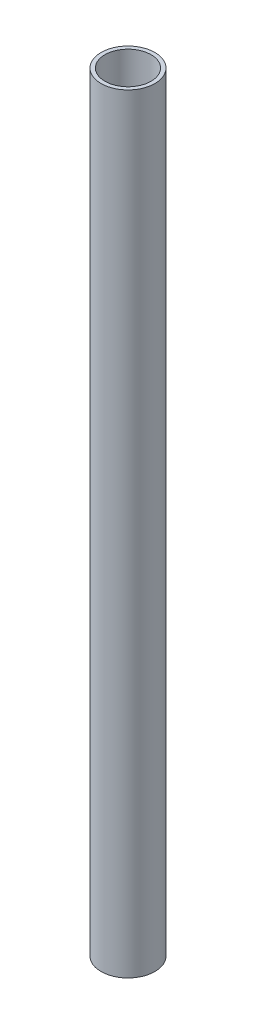
ISO-10303-21;
HEADER;
FILE_DESCRIPTION(('STEP AP214'),'2;1');
FILE_NAME('part.step','',(''),(''),'','','');
FILE_SCHEMA(('AUTOMOTIVE_DESIGN { 1 0 10303 214 1 1 1 1 }'));
ENDSEC;
DATA;
#1=APPLICATION_CONTEXT('core data for automotive mechanical design processes');
#2=APPLICATION_PROTOCOL_DEFINITION('international standard','automotive_design',2000,#1);
#3=PRODUCT_CONTEXT('',#1,'mechanical');
#4=PRODUCT('Part','Part','',(#3));
#5=PRODUCT_RELATED_PRODUCT_CATEGORY('part','',(#4));
#6=PRODUCT_DEFINITION_FORMATION('','',#4);
#7=PRODUCT_DEFINITION_CONTEXT('part definition',#1,'design');
#8=PRODUCT_DEFINITION('design','',#6,#7);
#9=PRODUCT_DEFINITION_SHAPE('','',#8);
#10=(LENGTH_UNIT() NAMED_UNIT(*) SI_UNIT(.MILLI.,.METRE.));
#11=(NAMED_UNIT(*) PLANE_ANGLE_UNIT() SI_UNIT($,.RADIAN.));
#12=(NAMED_UNIT(*) SI_UNIT($,.STERADIAN.) SOLID_ANGLE_UNIT());
#13=UNCERTAINTY_MEASURE_WITH_UNIT(LENGTH_MEASURE(1.E-05),#10,'distance_accuracy_value','');
#14=(GEOMETRIC_REPRESENTATION_CONTEXT(3) GLOBAL_UNCERTAINTY_ASSIGNED_CONTEXT((#13)) GLOBAL_UNIT_ASSIGNED_CONTEXT((#10,
#11,#12)) REPRESENTATION_CONTEXT('',''));
#15=CARTESIAN_POINT('',(0.,0.,0.));
#16=DIRECTION('',(0.,0.,1.));
#17=DIRECTION('',(1.,0.,0.));
#18=AXIS2_PLACEMENT_3D('',#15,#16,#17);
#19=CARTESIAN_POINT('',(0.,200.,0.));
#20=DIRECTION('',(0.,1.,0.));
#21=DIRECTION('',(0.,0.,1.));
#22=AXIS2_PLACEMENT_3D('',#19,#20,#21);
#23=PLANE('',#22);
#24=CARTESIAN_POINT('',(0.,200.,0.));
#25=DIRECTION('',(0.,1.,0.));
#26=DIRECTION('',(0.,0.,1.));
#27=AXIS2_PLACEMENT_3D('',#24,#25,#26);
#28=CIRCLE('',#27,7.);
#29=CARTESIAN_POINT('',(0.,200.,7.));
#30=VERTEX_POINT('',#29);
#31=EDGE_CURVE('E10',#30,#30,#28,.T.);
#32=ORIENTED_EDGE('',*,*,#31,.T.);
#33=EDGE_LOOP('',(#32));
#34=FACE_BOUND('',#33,.T.);
#35=CARTESIAN_POINT('',(0.,200.,0.));
#36=DIRECTION('',(0.,1.,0.));
#37=DIRECTION('',(0.,0.,1.));
#38=AXIS2_PLACEMENT_3D('',#35,#36,#37);
#39=CIRCLE('',#38,6.);
#40=CARTESIAN_POINT('',(0.,200.,6.));
#41=VERTEX_POINT('',#40);
#42=EDGE_CURVE('E43',#41,#41,#39,.T.);
#43=ORIENTED_EDGE('',*,*,#42,.F.);
#44=EDGE_LOOP('',(#43));
#45=FACE_BOUND('',#44,.T.);
#46=ADVANCED_FACE('F32',(#34,#45),#23,.T.);
#47=CARTESIAN_POINT('',(0.,0.,0.));
#48=DIRECTION('',(0.,1.,0.));
#49=DIRECTION('',(0.,0.,1.));
#50=AXIS2_PLACEMENT_3D('',#47,#48,#49);
#51=PLANE('',#50);
#52=CARTESIAN_POINT('',(0.,0.,0.));
#53=DIRECTION('',(0.,1.,0.));
#54=DIRECTION('',(0.,0.,1.));
#55=AXIS2_PLACEMENT_3D('',#52,#53,#54);
#56=CIRCLE('',#55,7.);
#57=CARTESIAN_POINT('',(0.,0.,7.));
#58=VERTEX_POINT('',#57);
#59=EDGE_CURVE('E36',#58,#58,#56,.T.);
#60=ORIENTED_EDGE('',*,*,#59,.F.);
#61=EDGE_LOOP('',(#60));
#62=FACE_BOUND('',#61,.T.);
#63=CARTESIAN_POINT('',(0.,0.,0.));
#64=DIRECTION('',(0.,1.,0.));
#65=DIRECTION('',(0.,0.,1.));
#66=AXIS2_PLACEMENT_3D('',#63,#64,#65);
#67=CIRCLE('',#66,6.);
#68=CARTESIAN_POINT('',(0.,0.,6.));
#69=VERTEX_POINT('',#68);
#70=EDGE_CURVE('E45',#69,#69,#67,.T.);
#71=ORIENTED_EDGE('',*,*,#70,.T.);
#72=EDGE_LOOP('',(#71));
#73=FACE_BOUND('',#72,.T.);
#74=ADVANCED_FACE('F55',(#62,#73),#51,.F.);
#75=CARTESIAN_POINT('',(0.,200.,0.));
#76=DIRECTION('',(0.,-1.,0.));
#77=DIRECTION('',(0.,0.,-1.));
#78=AXIS2_PLACEMENT_3D('',#75,#76,#77);
#79=CYLINDRICAL_SURFACE('',#78,7.);
#80=ORIENTED_EDGE('',*,*,#31,.F.);
#81=EDGE_LOOP('',(#80));
#82=FACE_BOUND('',#81,.T.);
#83=ORIENTED_EDGE('',*,*,#59,.T.);
#84=EDGE_LOOP('',(#83));
#85=FACE_BOUND('',#84,.T.);
#86=ADVANCED_FACE('F34',(#82,#85),#79,.T.);
#87=CARTESIAN_POINT('',(0.,200.,0.));
#88=DIRECTION('',(0.,-1.,0.));
#89=DIRECTION('',(0.,0.,-1.));
#90=AXIS2_PLACEMENT_3D('',#87,#88,#89);
#91=CYLINDRICAL_SURFACE('',#90,6.);
#92=ORIENTED_EDGE('',*,*,#42,.T.);
#93=EDGE_LOOP('',(#92));
#94=FACE_BOUND('',#93,.T.);
#95=ORIENTED_EDGE('',*,*,#70,.F.);
#96=EDGE_LOOP('',(#95));
#97=FACE_BOUND('',#96,.T.);
#98=ADVANCED_FACE('F51',(#94,#97),#91,.F.);
#99=CLOSED_SHELL('',(#46,#74,#86,#98));
#100=MANIFOLD_SOLID_BREP('B2',#99);
#101=ADVANCED_BREP_SHAPE_REPRESENTATION('',(#18,#100),#14);
#102=SHAPE_DEFINITION_REPRESENTATION(#9,#101);
ENDSEC;
END-ISO-10303-21;
